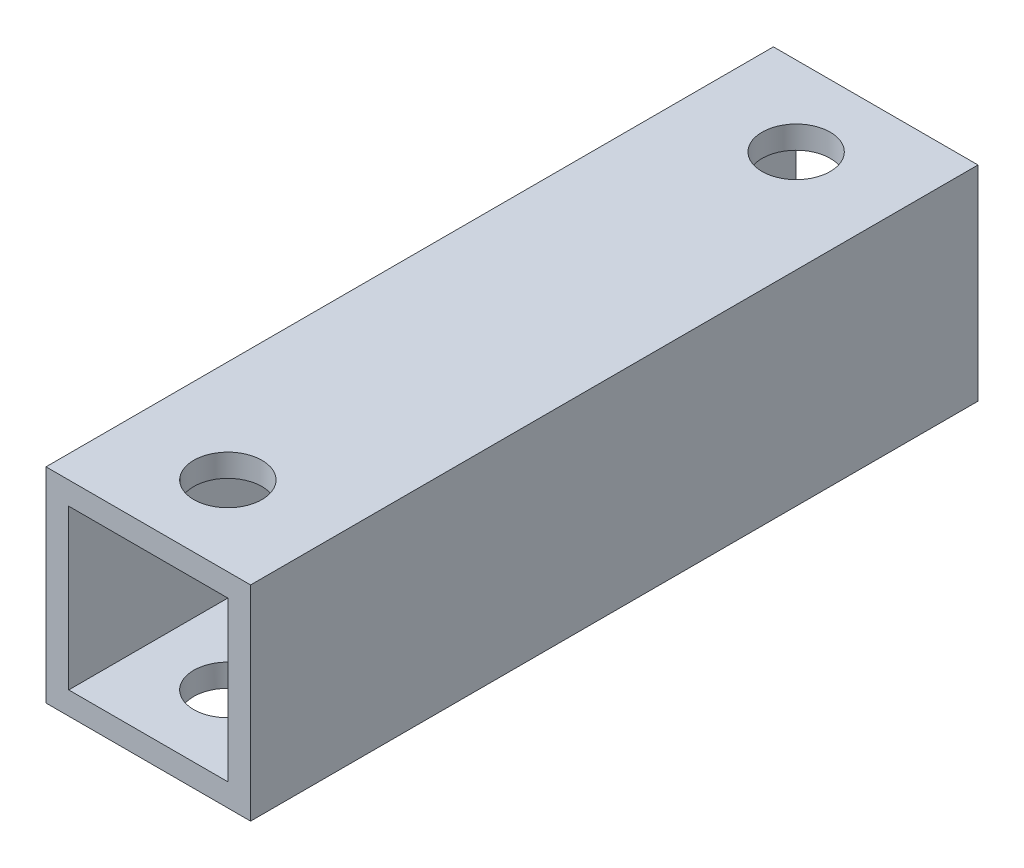
ISO-10303-21;
HEADER;
FILE_DESCRIPTION(('STEP AP214'),'2;1');
FILE_NAME('part.step','',(''),(''),'','','');
FILE_SCHEMA(('AUTOMOTIVE_DESIGN { 1 0 10303 214 1 1 1 1 }'));
ENDSEC;
DATA;
#1=APPLICATION_CONTEXT('core data for automotive mechanical design processes');
#2=APPLICATION_PROTOCOL_DEFINITION('international standard','automotive_design',2000,#1);
#3=PRODUCT_CONTEXT('',#1,'mechanical');
#4=PRODUCT('Part','Part','',(#3));
#5=PRODUCT_RELATED_PRODUCT_CATEGORY('part','',(#4));
#6=PRODUCT_DEFINITION_FORMATION('','',#4);
#7=PRODUCT_DEFINITION_CONTEXT('part definition',#1,'design');
#8=PRODUCT_DEFINITION('design','',#6,#7);
#9=PRODUCT_DEFINITION_SHAPE('','',#8);
#10=(LENGTH_UNIT() NAMED_UNIT(*) SI_UNIT(.MILLI.,.METRE.));
#11=(NAMED_UNIT(*) PLANE_ANGLE_UNIT() SI_UNIT($,.RADIAN.));
#12=(NAMED_UNIT(*) SI_UNIT($,.STERADIAN.) SOLID_ANGLE_UNIT());
#13=UNCERTAINTY_MEASURE_WITH_UNIT(LENGTH_MEASURE(1.E-05),#10,'distance_accuracy_value','');
#14=(GEOMETRIC_REPRESENTATION_CONTEXT(3) GLOBAL_UNCERTAINTY_ASSIGNED_CONTEXT((#13)) GLOBAL_UNIT_ASSIGNED_CONTEXT((#10,
#11,#12)) REPRESENTATION_CONTEXT('',''));
#15=CARTESIAN_POINT('',(0.,0.,0.));
#16=DIRECTION('',(0.,0.,1.));
#17=DIRECTION('',(1.,0.,0.));
#18=AXIS2_PLACEMENT_3D('',#15,#16,#17);
#19=CARTESIAN_POINT('',(4.5,4.5,32.));
#20=DIRECTION('',(-1.,0.,0.));
#21=DIRECTION('',(0.,0.,1.));
#22=AXIS2_PLACEMENT_3D('',#19,#20,#21);
#23=PLANE('',#22);
#24=DIRECTION('',(0.,1.,0.));
#25=VECTOR('',#24,1.);
#26=CARTESIAN_POINT('',(4.5,4.5,0.));
#27=LINE('',#26,#25);
#28=CARTESIAN_POINT('',(4.5,-4.5,0.));
#29=VERTEX_POINT('',#28);
#30=CARTESIAN_POINT('',(4.5,4.5,0.));
#31=VERTEX_POINT('',#30);
#32=EDGE_CURVE('E126',#29,#31,#27,.T.);
#33=ORIENTED_EDGE('',*,*,#32,.T.);
#34=DIRECTION('',(0.,0.,-1.));
#35=VECTOR('',#34,1.);
#36=CARTESIAN_POINT('',(4.5,4.5,32.));
#37=LINE('',#36,#35);
#38=CARTESIAN_POINT('',(4.5,4.5,32.));
#39=VERTEX_POINT('',#38);
#40=EDGE_CURVE('E155',#39,#31,#37,.T.);
#41=ORIENTED_EDGE('',*,*,#40,.F.);
#42=DIRECTION('',(0.,1.,0.));
#43=VECTOR('',#42,1.);
#44=CARTESIAN_POINT('',(4.5,4.5,32.));
#45=LINE('',#44,#43);
#46=CARTESIAN_POINT('',(4.5,-4.5,32.));
#47=VERTEX_POINT('',#46);
#48=EDGE_CURVE('E129',#47,#39,#45,.T.);
#49=ORIENTED_EDGE('',*,*,#48,.F.);
#50=DIRECTION('',(0.,0.,-1.));
#51=VECTOR('',#50,1.);
#52=CARTESIAN_POINT('',(4.5,-4.5,32.));
#53=LINE('',#52,#51);
#54=EDGE_CURVE('E139',#47,#29,#53,.T.);
#55=ORIENTED_EDGE('',*,*,#54,.T.);
#56=EDGE_LOOP('',(#33,#41,#49,#55));
#57=FACE_BOUND('',#56,.T.);
#58=ADVANCED_FACE('F34',(#57),#23,.F.);
#59=CARTESIAN_POINT('',(-4.5,4.5,32.));
#60=DIRECTION('',(0.,-1.,0.));
#61=DIRECTION('',(0.,0.,-1.));
#62=AXIS2_PLACEMENT_3D('',#59,#60,#61);
#63=PLANE('',#62);
#64=CARTESIAN_POINT('',(0.,4.5,3.5));
#65=DIRECTION('',(0.,1.,0.));
#66=DIRECTION('',(0.,0.,1.));
#67=AXIS2_PLACEMENT_3D('',#64,#65,#66);
#68=CIRCLE('',#67,1.5);
#69=CARTESIAN_POINT('',(0.,4.5,5.));
#70=VERTEX_POINT('',#69);
#71=EDGE_CURVE('E165',#70,#70,#68,.T.);
#72=ORIENTED_EDGE('',*,*,#71,.F.);
#73=EDGE_LOOP('',(#72));
#74=FACE_BOUND('',#73,.T.);
#75=CARTESIAN_POINT('',(0.,4.5,28.5));
#76=DIRECTION('',(0.,1.,0.));
#77=DIRECTION('',(0.,0.,1.));
#78=AXIS2_PLACEMENT_3D('',#75,#76,#77);
#79=CIRCLE('',#78,1.5);
#80=CARTESIAN_POINT('',(0.,4.5,30.));
#81=VERTEX_POINT('',#80);
#82=EDGE_CURVE('E172',#81,#81,#79,.T.);
#83=ORIENTED_EDGE('',*,*,#82,.F.);
#84=EDGE_LOOP('',(#83));
#85=FACE_BOUND('',#84,.T.);
#86=DIRECTION('',(-1.,0.,0.));
#87=VECTOR('',#86,1.);
#88=CARTESIAN_POINT('',(-4.5,4.5,0.));
#89=LINE('',#88,#87);
#90=CARTESIAN_POINT('',(-4.5,4.5,0.));
#91=VERTEX_POINT('',#90);
#92=EDGE_CURVE('E142',#31,#91,#89,.T.);
#93=ORIENTED_EDGE('',*,*,#92,.T.);
#94=DIRECTION('',(0.,0.,-1.));
#95=VECTOR('',#94,1.);
#96=CARTESIAN_POINT('',(-4.5,4.5,32.));
#97=LINE('',#96,#95);
#98=CARTESIAN_POINT('',(-4.5,4.5,32.));
#99=VERTEX_POINT('',#98);
#100=EDGE_CURVE('E152',#99,#91,#97,.T.);
#101=ORIENTED_EDGE('',*,*,#100,.F.);
#102=DIRECTION('',(-1.,0.,0.));
#103=VECTOR('',#102,1.);
#104=CARTESIAN_POINT('',(-4.5,4.5,32.));
#105=LINE('',#104,#103);
#106=EDGE_CURVE('E132',#39,#99,#105,.T.);
#107=ORIENTED_EDGE('',*,*,#106,.F.);
#108=ORIENTED_EDGE('',*,*,#40,.T.);
#109=EDGE_LOOP('',(#93,#101,#107,#108));
#110=FACE_BOUND('',#109,.T.);
#111=ADVANCED_FACE('F206',(#74,#85,#110),#63,.F.);
#112=CARTESIAN_POINT('',(-4.5,4.5,32.));
#113=DIRECTION('',(1.,0.,0.));
#114=DIRECTION('',(0.,0.,-1.));
#115=AXIS2_PLACEMENT_3D('',#112,#113,#114);
#116=PLANE('',#115);
#117=DIRECTION('',(0.,-1.,0.));
#118=VECTOR('',#117,1.);
#119=CARTESIAN_POINT('',(-4.5,4.5,0.));
#120=LINE('',#119,#118);
#121=CARTESIAN_POINT('',(-4.5,-4.5,0.));
#122=VERTEX_POINT('',#121);
#123=EDGE_CURVE('E144',#91,#122,#120,.T.);
#124=ORIENTED_EDGE('',*,*,#123,.T.);
#125=DIRECTION('',(0.,0.,-1.));
#126=VECTOR('',#125,1.);
#127=CARTESIAN_POINT('',(-4.5,-4.5,32.));
#128=LINE('',#127,#126);
#129=CARTESIAN_POINT('',(-4.5,-4.5,32.));
#130=VERTEX_POINT('',#129);
#131=EDGE_CURVE('E149',#130,#122,#128,.T.);
#132=ORIENTED_EDGE('',*,*,#131,.F.);
#133=DIRECTION('',(0.,-1.,0.));
#134=VECTOR('',#133,1.);
#135=CARTESIAN_POINT('',(-4.5,4.5,32.));
#136=LINE('',#135,#134);
#137=EDGE_CURVE('E135',#99,#130,#136,.T.);
#138=ORIENTED_EDGE('',*,*,#137,.F.);
#139=ORIENTED_EDGE('',*,*,#100,.T.);
#140=EDGE_LOOP('',(#124,#132,#138,#139));
#141=FACE_BOUND('',#140,.T.);
#142=ADVANCED_FACE('F211',(#141),#116,.F.);
#143=CARTESIAN_POINT('',(-4.5,-4.5,32.));
#144=DIRECTION('',(0.,1.,0.));
#145=DIRECTION('',(0.,0.,1.));
#146=AXIS2_PLACEMENT_3D('',#143,#144,#145);
#147=PLANE('',#146);
#148=CARTESIAN_POINT('',(0.,-4.5,3.5));
#149=DIRECTION('',(0.,1.,0.));
#150=DIRECTION('',(0.,0.,1.));
#151=AXIS2_PLACEMENT_3D('',#148,#149,#150);
#152=CIRCLE('',#151,1.5);
#153=CARTESIAN_POINT('',(0.,-4.5,5.));
#154=VERTEX_POINT('',#153);
#155=EDGE_CURVE('E184',#154,#154,#152,.T.);
#156=ORIENTED_EDGE('',*,*,#155,.T.);
#157=EDGE_LOOP('',(#156));
#158=FACE_BOUND('',#157,.T.);
#159=CARTESIAN_POINT('',(0.,-4.5,28.5));
#160=DIRECTION('',(0.,1.,0.));
#161=DIRECTION('',(0.,0.,1.));
#162=AXIS2_PLACEMENT_3D('',#159,#160,#161);
#163=CIRCLE('',#162,1.5);
#164=CARTESIAN_POINT('',(0.,-4.5,30.));
#165=VERTEX_POINT('',#164);
#166=EDGE_CURVE('E169',#165,#165,#163,.T.);
#167=ORIENTED_EDGE('',*,*,#166,.T.);
#168=EDGE_LOOP('',(#167));
#169=FACE_BOUND('',#168,.T.);
#170=DIRECTION('',(1.,0.,0.));
#171=VECTOR('',#170,1.);
#172=CARTESIAN_POINT('',(-4.5,-4.5,0.));
#173=LINE('',#172,#171);
#174=EDGE_CURVE('E133',#122,#29,#173,.T.);
#175=ORIENTED_EDGE('',*,*,#174,.T.);
#176=ORIENTED_EDGE('',*,*,#54,.F.);
#177=DIRECTION('',(1.,0.,0.));
#178=VECTOR('',#177,1.);
#179=CARTESIAN_POINT('',(-4.5,-4.5,32.));
#180=LINE('',#179,#178);
#181=EDGE_CURVE('E137',#130,#47,#180,.T.);
#182=ORIENTED_EDGE('',*,*,#181,.F.);
#183=ORIENTED_EDGE('',*,*,#131,.T.);
#184=EDGE_LOOP('',(#175,#176,#182,#183));
#185=FACE_BOUND('',#184,.T.);
#186=ADVANCED_FACE('F188',(#158,#169,#185),#147,.F.);
#187=CARTESIAN_POINT('',(0.,0.,32.));
#188=DIRECTION('',(0.,0.,1.));
#189=DIRECTION('',(1.,0.,0.));
#190=AXIS2_PLACEMENT_3D('',#187,#188,#189);
#191=PLANE('',#190);
#192=DIRECTION('',(0.,1.,0.));
#193=VECTOR('',#192,1.);
#194=CARTESIAN_POINT('',(3.5,3.5,32.));
#195=LINE('',#194,#193);
#196=CARTESIAN_POINT('',(3.5,-3.5,32.));
#197=VERTEX_POINT('',#196);
#198=CARTESIAN_POINT('',(3.5,3.5,32.));
#199=VERTEX_POINT('',#198);
#200=EDGE_CURVE('E50',#197,#199,#195,.T.);
#201=ORIENTED_EDGE('',*,*,#200,.F.);
#202=DIRECTION('',(1.,0.,0.));
#203=VECTOR('',#202,1.);
#204=CARTESIAN_POINT('',(-3.5,-3.5,32.));
#205=LINE('',#204,#203);
#206=CARTESIAN_POINT('',(-3.5,-3.5,32.));
#207=VERTEX_POINT('',#206);
#208=EDGE_CURVE('E119',#207,#197,#205,.T.);
#209=ORIENTED_EDGE('',*,*,#208,.F.);
#210=DIRECTION('',(0.,-1.,0.));
#211=VECTOR('',#210,1.);
#212=CARTESIAN_POINT('',(-3.5,3.5,32.));
#213=LINE('',#212,#211);
#214=CARTESIAN_POINT('',(-3.5,3.5,32.));
#215=VERTEX_POINT('',#214);
#216=EDGE_CURVE('E103',#215,#207,#213,.T.);
#217=ORIENTED_EDGE('',*,*,#216,.F.);
#218=DIRECTION('',(-1.,0.,0.));
#219=VECTOR('',#218,1.);
#220=CARTESIAN_POINT('',(-3.5,3.5,32.));
#221=LINE('',#220,#219);
#222=EDGE_CURVE('E112',#199,#215,#221,.T.);
#223=ORIENTED_EDGE('',*,*,#222,.F.);
#224=EDGE_LOOP('',(#201,#209,#217,#223));
#225=FACE_BOUND('',#224,.T.);
#226=ORIENTED_EDGE('',*,*,#48,.T.);
#227=ORIENTED_EDGE('',*,*,#106,.T.);
#228=ORIENTED_EDGE('',*,*,#137,.T.);
#229=ORIENTED_EDGE('',*,*,#181,.T.);
#230=EDGE_LOOP('',(#226,#227,#228,#229));
#231=FACE_BOUND('',#230,.T.);
#232=ADVANCED_FACE('F116',(#225,#231),#191,.T.);
#233=CARTESIAN_POINT('',(0.,0.,0.));
#234=DIRECTION('',(0.,0.,1.));
#235=DIRECTION('',(1.,0.,0.));
#236=AXIS2_PLACEMENT_3D('',#233,#234,#235);
#237=PLANE('',#236);
#238=DIRECTION('',(1.,0.,0.));
#239=VECTOR('',#238,1.);
#240=CARTESIAN_POINT('',(0.,-3.5,0.));
#241=LINE('',#240,#239);
#242=CARTESIAN_POINT('',(-3.5,-3.5,0.));
#243=VERTEX_POINT('',#242);
#244=CARTESIAN_POINT('',(3.5,-3.5,0.));
#245=VERTEX_POINT('',#244);
#246=EDGE_CURVE('E42',#243,#245,#241,.T.);
#247=ORIENTED_EDGE('',*,*,#246,.T.);
#248=DIRECTION('',(0.,1.,0.));
#249=VECTOR('',#248,1.);
#250=CARTESIAN_POINT('',(3.5,0.,0.));
#251=LINE('',#250,#249);
#252=CARTESIAN_POINT('',(3.5,3.5,0.));
#253=VERTEX_POINT('',#252);
#254=EDGE_CURVE('E11',#245,#253,#251,.T.);
#255=ORIENTED_EDGE('',*,*,#254,.T.);
#256=DIRECTION('',(-1.,0.,0.));
#257=VECTOR('',#256,1.);
#258=CARTESIAN_POINT('',(0.,3.5,0.));
#259=LINE('',#258,#257);
#260=CARTESIAN_POINT('',(-3.5,3.5,0.));
#261=VERTEX_POINT('',#260);
#262=EDGE_CURVE('E158',#253,#261,#259,.T.);
#263=ORIENTED_EDGE('',*,*,#262,.T.);
#264=DIRECTION('',(0.,-1.,0.));
#265=VECTOR('',#264,1.);
#266=CARTESIAN_POINT('',(-3.5,0.,0.));
#267=LINE('',#266,#265);
#268=EDGE_CURVE('E106',#261,#243,#267,.T.);
#269=ORIENTED_EDGE('',*,*,#268,.T.);
#270=EDGE_LOOP('',(#247,#255,#263,#269));
#271=FACE_BOUND('',#270,.T.);
#272=ORIENTED_EDGE('',*,*,#32,.F.);
#273=ORIENTED_EDGE('',*,*,#174,.F.);
#274=ORIENTED_EDGE('',*,*,#123,.F.);
#275=ORIENTED_EDGE('',*,*,#92,.F.);
#276=EDGE_LOOP('',(#272,#273,#274,#275));
#277=FACE_BOUND('',#276,.T.);
#278=ADVANCED_FACE('F219',(#271,#277),#237,.F.);
#279=CARTESIAN_POINT('',(3.5,3.5,-8.));
#280=DIRECTION('',(1.,0.,0.));
#281=DIRECTION('',(0.,1.,0.));
#282=AXIS2_PLACEMENT_3D('',#279,#280,#281);
#283=PLANE('',#282);
#284=DIRECTION('',(0.,0.,1.));
#285=VECTOR('',#284,1.);
#286=CARTESIAN_POINT('',(3.5,-3.5,-8.));
#287=LINE('',#286,#285);
#288=EDGE_CURVE('E124',#245,#197,#287,.T.);
#289=ORIENTED_EDGE('',*,*,#288,.T.);
#290=ORIENTED_EDGE('',*,*,#200,.T.);
#291=DIRECTION('',(0.,0.,1.));
#292=VECTOR('',#291,1.);
#293=CARTESIAN_POINT('',(3.5,3.5,-8.));
#294=LINE('',#293,#292);
#295=EDGE_CURVE('E109',#253,#199,#294,.T.);
#296=ORIENTED_EDGE('',*,*,#295,.F.);
#297=ORIENTED_EDGE('',*,*,#254,.F.);
#298=EDGE_LOOP('',(#289,#290,#296,#297));
#299=FACE_BOUND('',#298,.T.);
#300=ADVANCED_FACE('F237',(#299),#283,.F.);
#301=CARTESIAN_POINT('',(-3.5,-3.5,-8.));
#302=DIRECTION('',(0.,-1.,0.));
#303=DIRECTION('',(0.,0.,-1.));
#304=AXIS2_PLACEMENT_3D('',#301,#302,#303);
#305=PLANE('',#304);
#306=CARTESIAN_POINT('',(0.,-3.5,3.5));
#307=DIRECTION('',(0.,-1.,0.));
#308=DIRECTION('',(0.,0.,-1.));
#309=AXIS2_PLACEMENT_3D('',#306,#307,#308);
#310=CIRCLE('',#309,1.5);
#311=CARTESIAN_POINT('',(0.,-3.5,2.));
#312=VERTEX_POINT('',#311);
#313=EDGE_CURVE('E181',#312,#312,#310,.T.);
#314=ORIENTED_EDGE('',*,*,#313,.T.);
#315=EDGE_LOOP('',(#314));
#316=FACE_BOUND('',#315,.T.);
#317=CARTESIAN_POINT('',(0.,-3.5,28.5));
#318=DIRECTION('',(0.,-1.,0.));
#319=DIRECTION('',(0.,0.,-1.));
#320=AXIS2_PLACEMENT_3D('',#317,#318,#319);
#321=CIRCLE('',#320,1.5);
#322=CARTESIAN_POINT('',(0.,-3.5,27.));
#323=VERTEX_POINT('',#322);
#324=EDGE_CURVE('E164',#323,#323,#321,.T.);
#325=ORIENTED_EDGE('',*,*,#324,.T.);
#326=EDGE_LOOP('',(#325));
#327=FACE_BOUND('',#326,.T.);
#328=DIRECTION('',(0.,0.,1.));
#329=VECTOR('',#328,1.);
#330=CARTESIAN_POINT('',(-3.5,-3.5,-8.));
#331=LINE('',#330,#329);
#332=EDGE_CURVE('E108',#243,#207,#331,.T.);
#333=ORIENTED_EDGE('',*,*,#332,.T.);
#334=ORIENTED_EDGE('',*,*,#208,.T.);
#335=ORIENTED_EDGE('',*,*,#288,.F.);
#336=ORIENTED_EDGE('',*,*,#246,.F.);
#337=EDGE_LOOP('',(#333,#334,#335,#336));
#338=FACE_BOUND('',#337,.T.);
#339=ADVANCED_FACE('F243',(#316,#327,#338),#305,.F.);
#340=CARTESIAN_POINT('',(-3.5,3.5,-8.));
#341=DIRECTION('',(-1.,0.,0.));
#342=DIRECTION('',(0.,-1.,0.));
#343=AXIS2_PLACEMENT_3D('',#340,#341,#342);
#344=PLANE('',#343);
#345=DIRECTION('',(0.,0.,1.));
#346=VECTOR('',#345,1.);
#347=CARTESIAN_POINT('',(-3.5,3.5,-8.));
#348=LINE('',#347,#346);
#349=EDGE_CURVE('E58',#261,#215,#348,.T.);
#350=ORIENTED_EDGE('',*,*,#349,.T.);
#351=ORIENTED_EDGE('',*,*,#216,.T.);
#352=ORIENTED_EDGE('',*,*,#332,.F.);
#353=ORIENTED_EDGE('',*,*,#268,.F.);
#354=EDGE_LOOP('',(#350,#351,#352,#353));
#355=FACE_BOUND('',#354,.T.);
#356=ADVANCED_FACE('F100',(#355),#344,.F.);
#357=CARTESIAN_POINT('',(-3.5,3.5,-8.));
#358=DIRECTION('',(0.,1.,0.));
#359=DIRECTION('',(0.,0.,1.));
#360=AXIS2_PLACEMENT_3D('',#357,#358,#359);
#361=PLANE('',#360);
#362=CARTESIAN_POINT('',(0.,3.5,3.5));
#363=DIRECTION('',(0.,1.,0.));
#364=DIRECTION('',(0.,0.,1.));
#365=AXIS2_PLACEMENT_3D('',#362,#363,#364);
#366=CIRCLE('',#365,1.5);
#367=CARTESIAN_POINT('',(0.,3.5,5.));
#368=VERTEX_POINT('',#367);
#369=EDGE_CURVE('E37',#368,#368,#366,.T.);
#370=ORIENTED_EDGE('',*,*,#369,.T.);
#371=EDGE_LOOP('',(#370));
#372=FACE_BOUND('',#371,.T.);
#373=CARTESIAN_POINT('',(0.,3.5,28.5));
#374=DIRECTION('',(0.,1.,0.));
#375=DIRECTION('',(0.,0.,1.));
#376=AXIS2_PLACEMENT_3D('',#373,#374,#375);
#377=CIRCLE('',#376,1.5);
#378=CARTESIAN_POINT('',(0.,3.5,30.));
#379=VERTEX_POINT('',#378);
#380=EDGE_CURVE('E162',#379,#379,#377,.T.);
#381=ORIENTED_EDGE('',*,*,#380,.T.);
#382=EDGE_LOOP('',(#381));
#383=FACE_BOUND('',#382,.T.);
#384=ORIENTED_EDGE('',*,*,#295,.T.);
#385=ORIENTED_EDGE('',*,*,#222,.T.);
#386=ORIENTED_EDGE('',*,*,#349,.F.);
#387=ORIENTED_EDGE('',*,*,#262,.F.);
#388=EDGE_LOOP('',(#384,#385,#386,#387));
#389=FACE_BOUND('',#388,.T.);
#390=ADVANCED_FACE('F113',(#372,#383,#389),#361,.F.);
#391=CARTESIAN_POINT('',(0.,-33.5,28.5));
#392=DIRECTION('',(0.,1.,0.));
#393=DIRECTION('',(0.,0.,1.));
#394=AXIS2_PLACEMENT_3D('',#391,#392,#393);
#395=CYLINDRICAL_SURFACE('',#394,1.5);
#396=ORIENTED_EDGE('',*,*,#82,.T.);
#397=EDGE_LOOP('',(#396));
#398=FACE_BOUND('',#397,.T.);
#399=ORIENTED_EDGE('',*,*,#380,.F.);
#400=EDGE_LOOP('',(#399));
#401=FACE_BOUND('',#400,.T.);
#402=ADVANCED_FACE('F202',(#398,#401),#395,.F.);
#403=CARTESIAN_POINT('',(0.,-33.5,3.5));
#404=DIRECTION('',(0.,1.,0.));
#405=DIRECTION('',(0.,0.,1.));
#406=AXIS2_PLACEMENT_3D('',#403,#404,#405);
#407=CYLINDRICAL_SURFACE('',#406,1.5);
#408=ORIENTED_EDGE('',*,*,#71,.T.);
#409=EDGE_LOOP('',(#408));
#410=FACE_BOUND('',#409,.T.);
#411=ORIENTED_EDGE('',*,*,#369,.F.);
#412=EDGE_LOOP('',(#411));
#413=FACE_BOUND('',#412,.T.);
#414=ADVANCED_FACE('F196',(#410,#413),#407,.F.);
#415=ORIENTED_EDGE('',*,*,#324,.F.);
#416=EDGE_LOOP('',(#415));
#417=FACE_BOUND('',#416,.T.);
#418=ORIENTED_EDGE('',*,*,#166,.F.);
#419=EDGE_LOOP('',(#418));
#420=FACE_BOUND('',#419,.T.);
#421=ADVANCED_FACE('F193',(#417,#420),#395,.F.);
#422=ORIENTED_EDGE('',*,*,#313,.F.);
#423=EDGE_LOOP('',(#422));
#424=FACE_BOUND('',#423,.T.);
#425=ORIENTED_EDGE('',*,*,#155,.F.);
#426=EDGE_LOOP('',(#425));
#427=FACE_BOUND('',#426,.T.);
#428=ADVANCED_FACE('F191',(#424,#427),#407,.F.);
#429=CLOSED_SHELL('',(#58,#111,#142,#186,#232,#278,#300,#339,#356,#390,#402,#414,#421,#428));
#430=MANIFOLD_SOLID_BREP('B2',#429);
#431=ADVANCED_BREP_SHAPE_REPRESENTATION('',(#18,#430),#14);
#432=SHAPE_DEFINITION_REPRESENTATION(#9,#431);
ENDSEC;
END-ISO-10303-21;
